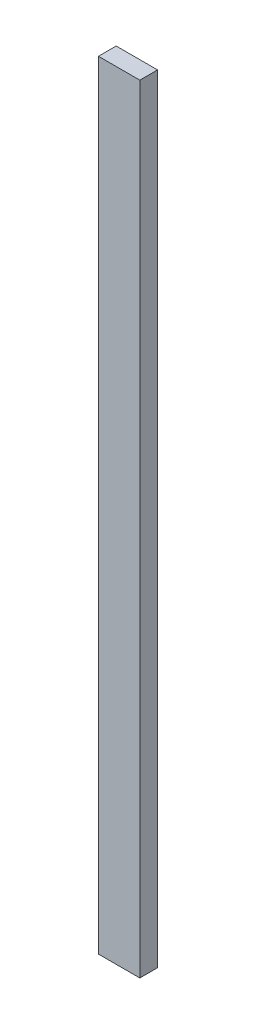
ISO-10303-21;
HEADER;
FILE_DESCRIPTION(('STEP AP214'),'2;1');
FILE_NAME('part.step','',(''),(''),'','','');
FILE_SCHEMA(('AUTOMOTIVE_DESIGN { 1 0 10303 214 1 1 1 1 }'));
ENDSEC;
DATA;
#1=APPLICATION_CONTEXT('core data for automotive mechanical design processes');
#2=APPLICATION_PROTOCOL_DEFINITION('international standard','automotive_design',2000,#1);
#3=PRODUCT_CONTEXT('',#1,'mechanical');
#4=PRODUCT('Part','Part','',(#3));
#5=PRODUCT_RELATED_PRODUCT_CATEGORY('part','',(#4));
#6=PRODUCT_DEFINITION_FORMATION('','',#4);
#7=PRODUCT_DEFINITION_CONTEXT('part definition',#1,'design');
#8=PRODUCT_DEFINITION('design','',#6,#7);
#9=PRODUCT_DEFINITION_SHAPE('','',#8);
#10=(LENGTH_UNIT() NAMED_UNIT(*) SI_UNIT(.MILLI.,.METRE.));
#11=(NAMED_UNIT(*) PLANE_ANGLE_UNIT() SI_UNIT($,.RADIAN.));
#12=(NAMED_UNIT(*) SI_UNIT($,.STERADIAN.) SOLID_ANGLE_UNIT());
#13=UNCERTAINTY_MEASURE_WITH_UNIT(LENGTH_MEASURE(1.E-05),#10,'distance_accuracy_value','');
#14=(GEOMETRIC_REPRESENTATION_CONTEXT(3) GLOBAL_UNCERTAINTY_ASSIGNED_CONTEXT((#13)) GLOBAL_UNIT_ASSIGNED_CONTEXT((#10,
#11,#12)) REPRESENTATION_CONTEXT('',''));
#15=CARTESIAN_POINT('',(0.,0.,0.));
#16=DIRECTION('',(0.,0.,1.));
#17=DIRECTION('',(1.,0.,0.));
#18=AXIS2_PLACEMENT_3D('',#15,#16,#17);
#19=CARTESIAN_POINT('',(-44.45,1670.05,19.05));
#20=DIRECTION('',(-1.,0.,0.));
#21=DIRECTION('',(0.,0.,1.));
#22=AXIS2_PLACEMENT_3D('',#19,#20,#21);
#23=PLANE('',#22);
#24=DIRECTION('',(0.,0.,-1.));
#25=VECTOR('',#24,1.);
#26=CARTESIAN_POINT('',(-44.45,0.,19.05));
#27=LINE('',#26,#25);
#28=CARTESIAN_POINT('',(-44.45,0.,19.05));
#29=VERTEX_POINT('',#28);
#30=CARTESIAN_POINT('',(-44.45,0.,-19.05));
#31=VERTEX_POINT('',#30);
#32=EDGE_CURVE('E104',#29,#31,#27,.T.);
#33=ORIENTED_EDGE('',*,*,#32,.F.);
#34=DIRECTION('',(0.,-1.,0.));
#35=VECTOR('',#34,1.);
#36=CARTESIAN_POINT('',(-44.45,1670.05,19.05));
#37=LINE('',#36,#35);
#38=CARTESIAN_POINT('',(-44.45,1670.05,19.05));
#39=VERTEX_POINT('',#38);
#40=EDGE_CURVE('E11',#39,#29,#37,.T.);
#41=ORIENTED_EDGE('',*,*,#40,.F.);
#42=DIRECTION('',(0.,0.,-1.));
#43=VECTOR('',#42,1.);
#44=CARTESIAN_POINT('',(-44.45,1670.05,19.05));
#45=LINE('',#44,#43);
#46=CARTESIAN_POINT('',(-44.45,1670.05,-19.05));
#47=VERTEX_POINT('',#46);
#48=EDGE_CURVE('E99',#39,#47,#45,.T.);
#49=ORIENTED_EDGE('',*,*,#48,.T.);
#50=DIRECTION('',(0.,-1.,0.));
#51=VECTOR('',#50,1.);
#52=CARTESIAN_POINT('',(-44.45,1670.05,-19.05));
#53=LINE('',#52,#51);
#54=EDGE_CURVE('E42',#47,#31,#53,.T.);
#55=ORIENTED_EDGE('',*,*,#54,.T.);
#56=EDGE_LOOP('',(#33,#41,#49,#55));
#57=FACE_BOUND('',#56,.T.);
#58=ADVANCED_FACE('F39',(#57),#23,.T.);
#59=CARTESIAN_POINT('',(-44.45,1670.05,19.05));
#60=DIRECTION('',(0.,0.,-1.));
#61=DIRECTION('',(-1.,0.,0.));
#62=AXIS2_PLACEMENT_3D('',#59,#60,#61);
#63=PLANE('',#62);
#64=DIRECTION('',(1.,0.,0.));
#65=VECTOR('',#64,1.);
#66=CARTESIAN_POINT('',(-44.45,0.,19.05));
#67=LINE('',#66,#65);
#68=CARTESIAN_POINT('',(44.45,0.,19.05));
#69=VERTEX_POINT('',#68);
#70=EDGE_CURVE('E72',#29,#69,#67,.T.);
#71=ORIENTED_EDGE('',*,*,#70,.T.);
#72=DIRECTION('',(0.,-1.,0.));
#73=VECTOR('',#72,1.);
#74=CARTESIAN_POINT('',(44.45,1670.05,19.05));
#75=LINE('',#74,#73);
#76=CARTESIAN_POINT('',(44.45,1670.05,19.05));
#77=VERTEX_POINT('',#76);
#78=EDGE_CURVE('E48',#77,#69,#75,.T.);
#79=ORIENTED_EDGE('',*,*,#78,.F.);
#80=DIRECTION('',(1.,0.,0.));
#81=VECTOR('',#80,1.);
#82=CARTESIAN_POINT('',(-44.45,1670.05,19.05));
#83=LINE('',#82,#81);
#84=EDGE_CURVE('E89',#39,#77,#83,.T.);
#85=ORIENTED_EDGE('',*,*,#84,.F.);
#86=ORIENTED_EDGE('',*,*,#40,.T.);
#87=EDGE_LOOP('',(#71,#79,#85,#86));
#88=FACE_BOUND('',#87,.T.);
#89=ADVANCED_FACE('F114',(#88),#63,.F.);
#90=CARTESIAN_POINT('',(44.45,1670.05,19.05));
#91=DIRECTION('',(-1.,0.,0.));
#92=DIRECTION('',(0.,0.,1.));
#93=AXIS2_PLACEMENT_3D('',#90,#91,#92);
#94=PLANE('',#93);
#95=DIRECTION('',(0.,0.,-1.));
#96=VECTOR('',#95,1.);
#97=CARTESIAN_POINT('',(44.45,0.,19.05));
#98=LINE('',#97,#96);
#99=CARTESIAN_POINT('',(44.45,0.,-19.05));
#100=VERTEX_POINT('',#99);
#101=EDGE_CURVE('E96',#69,#100,#98,.T.);
#102=ORIENTED_EDGE('',*,*,#101,.T.);
#103=DIRECTION('',(0.,-1.,0.));
#104=VECTOR('',#103,1.);
#105=CARTESIAN_POINT('',(44.45,1670.05,-19.05));
#106=LINE('',#105,#104);
#107=CARTESIAN_POINT('',(44.45,1670.05,-19.05));
#108=VERTEX_POINT('',#107);
#109=EDGE_CURVE('E93',#108,#100,#106,.T.);
#110=ORIENTED_EDGE('',*,*,#109,.F.);
#111=DIRECTION('',(0.,0.,-1.));
#112=VECTOR('',#111,1.);
#113=CARTESIAN_POINT('',(44.45,1670.05,19.05));
#114=LINE('',#113,#112);
#115=EDGE_CURVE('E84',#77,#108,#114,.T.);
#116=ORIENTED_EDGE('',*,*,#115,.F.);
#117=ORIENTED_EDGE('',*,*,#78,.T.);
#118=EDGE_LOOP('',(#102,#110,#116,#117));
#119=FACE_BOUND('',#118,.T.);
#120=ADVANCED_FACE('F94',(#119),#94,.F.);
#121=CARTESIAN_POINT('',(-44.45,1670.05,-19.05));
#122=DIRECTION('',(0.,0.,-1.));
#123=DIRECTION('',(-1.,0.,0.));
#124=AXIS2_PLACEMENT_3D('',#121,#122,#123);
#125=PLANE('',#124);
#126=DIRECTION('',(1.,0.,0.));
#127=VECTOR('',#126,1.);
#128=CARTESIAN_POINT('',(-44.45,0.,-19.05));
#129=LINE('',#128,#127);
#130=EDGE_CURVE('E107',#31,#100,#129,.T.);
#131=ORIENTED_EDGE('',*,*,#130,.F.);
#132=ORIENTED_EDGE('',*,*,#54,.F.);
#133=DIRECTION('',(1.,0.,0.));
#134=VECTOR('',#133,1.);
#135=CARTESIAN_POINT('',(-44.45,1670.05,-19.05));
#136=LINE('',#135,#134);
#137=EDGE_CURVE('E88',#47,#108,#136,.T.);
#138=ORIENTED_EDGE('',*,*,#137,.T.);
#139=ORIENTED_EDGE('',*,*,#109,.T.);
#140=EDGE_LOOP('',(#131,#132,#138,#139));
#141=FACE_BOUND('',#140,.T.);
#142=ADVANCED_FACE('F98',(#141),#125,.T.);
#143=CARTESIAN_POINT('',(0.,1670.05,0.));
#144=DIRECTION('',(0.,-1.,0.));
#145=DIRECTION('',(0.,0.,-1.));
#146=AXIS2_PLACEMENT_3D('',#143,#144,#145);
#147=PLANE('',#146);
#148=ORIENTED_EDGE('',*,*,#48,.F.);
#149=ORIENTED_EDGE('',*,*,#84,.T.);
#150=ORIENTED_EDGE('',*,*,#115,.T.);
#151=ORIENTED_EDGE('',*,*,#137,.F.);
#152=EDGE_LOOP('',(#148,#149,#150,#151));
#153=FACE_BOUND('',#152,.T.);
#154=ADVANCED_FACE('F87',(#153),#147,.F.);
#155=CARTESIAN_POINT('',(0.,0.,0.));
#156=DIRECTION('',(0.,-1.,0.));
#157=DIRECTION('',(0.,0.,-1.));
#158=AXIS2_PLACEMENT_3D('',#155,#156,#157);
#159=PLANE('',#158);
#160=ORIENTED_EDGE('',*,*,#32,.T.);
#161=ORIENTED_EDGE('',*,*,#130,.T.);
#162=ORIENTED_EDGE('',*,*,#101,.F.);
#163=ORIENTED_EDGE('',*,*,#70,.F.);
#164=EDGE_LOOP('',(#160,#161,#162,#163));
#165=FACE_BOUND('',#164,.T.);
#166=ADVANCED_FACE('F112',(#165),#159,.T.);
#167=CLOSED_SHELL('',(#58,#89,#120,#142,#154,#166));
#168=MANIFOLD_SOLID_BREP('B2',#167);
#169=ADVANCED_BREP_SHAPE_REPRESENTATION('',(#18,#168),#14);
#170=SHAPE_DEFINITION_REPRESENTATION(#9,#169);
ENDSEC;
END-ISO-10303-21;
